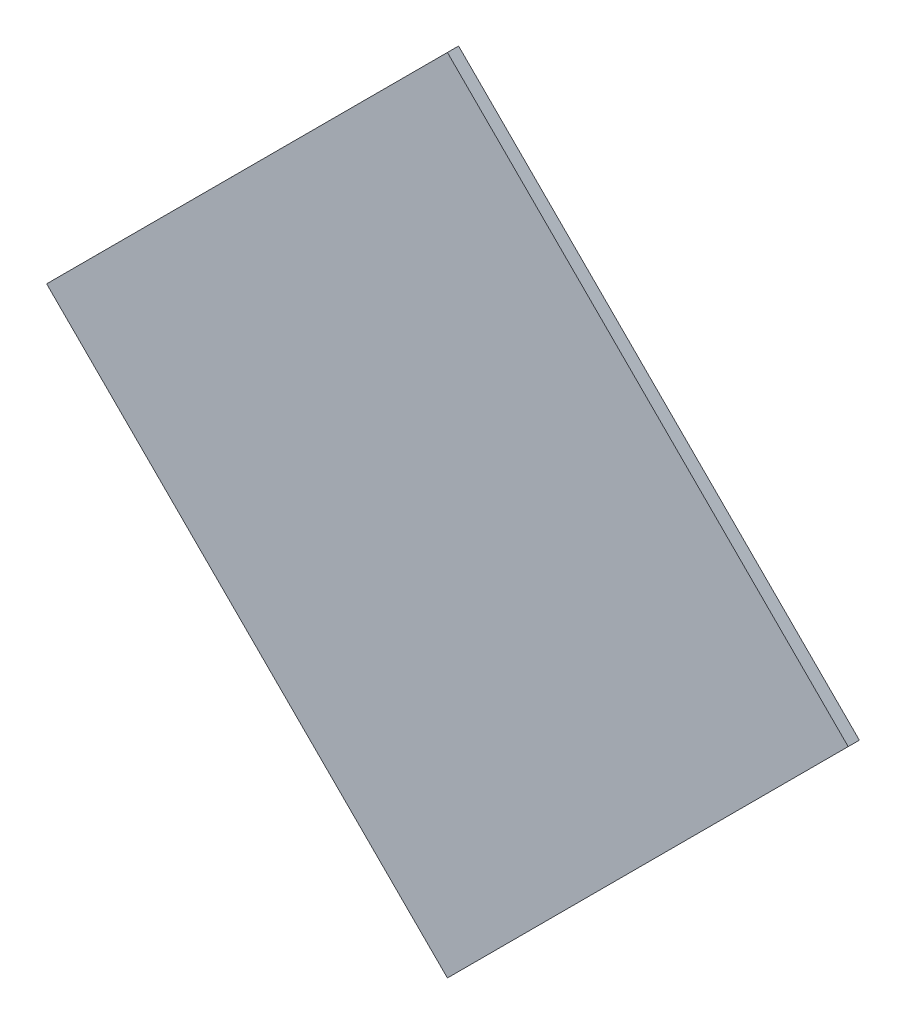
ISO-10303-21;
HEADER;
FILE_DESCRIPTION(('STEP AP214'),'2;1');
FILE_NAME('part.step','',(''),(''),'','','');
FILE_SCHEMA(('AUTOMOTIVE_DESIGN { 1 0 10303 214 1 1 1 1 }'));
ENDSEC;
DATA;
#1=APPLICATION_CONTEXT('core data for automotive mechanical design processes');
#2=APPLICATION_PROTOCOL_DEFINITION('international standard','automotive_design',2000,#1);
#3=PRODUCT_CONTEXT('',#1,'mechanical');
#4=PRODUCT('Part','Part','',(#3));
#5=PRODUCT_RELATED_PRODUCT_CATEGORY('part','',(#4));
#6=PRODUCT_DEFINITION_FORMATION('','',#4);
#7=PRODUCT_DEFINITION_CONTEXT('part definition',#1,'design');
#8=PRODUCT_DEFINITION('design','',#6,#7);
#9=PRODUCT_DEFINITION_SHAPE('','',#8);
#10=(LENGTH_UNIT() NAMED_UNIT(*) SI_UNIT(.MILLI.,.METRE.));
#11=(NAMED_UNIT(*) PLANE_ANGLE_UNIT() SI_UNIT($,.RADIAN.));
#12=(NAMED_UNIT(*) SI_UNIT($,.STERADIAN.) SOLID_ANGLE_UNIT());
#13=UNCERTAINTY_MEASURE_WITH_UNIT(LENGTH_MEASURE(1.E-05),#10,'distance_accuracy_value','');
#14=(GEOMETRIC_REPRESENTATION_CONTEXT(3) GLOBAL_UNCERTAINTY_ASSIGNED_CONTEXT((#13)) GLOBAL_UNIT_ASSIGNED_CONTEXT((#10,
#11,#12)) REPRESENTATION_CONTEXT('',''));
#15=CARTESIAN_POINT('',(0.,0.,0.));
#16=DIRECTION('',(0.,0.,1.));
#17=DIRECTION('',(1.,0.,0.));
#18=AXIS2_PLACEMENT_3D('',#15,#16,#17);
#19=CARTESIAN_POINT('',(-0.35920934,0.,0.));
#20=DIRECTION('',(-0.707109281179628,0.707104281184628,0.));
#21=DIRECTION('',(0.707104281184628,0.707109281179628,0.));
#22=AXIS2_PLACEMENT_3D('',#19,#20,#21);
#23=PLANE('',#22);
#24=DIRECTION('',(0.,0.,1.));
#25=VECTOR('',#24,1.);
#26=CARTESIAN_POINT('',(-0.35920934,0.,0.));
#27=LINE('',#26,#25);
#28=CARTESIAN_POINT('',(-0.35920934,0.,0.));
#29=VERTEX_POINT('',#28);
#30=CARTESIAN_POINT('',(-0.35920934,0.,0.00999998));
#31=VERTEX_POINT('',#30);
#32=EDGE_CURVE('E11',#29,#31,#27,.T.);
#33=ORIENTED_EDGE('',*,*,#32,.T.);
#34=DIRECTION('',(0.707104281184628,0.707109281179628,0.));
#35=VECTOR('',#34,1.);
#36=CARTESIAN_POINT('',(-0.35920934,0.,0.00999998));
#37=LINE('',#36,#35);
#38=CARTESIAN_POINT('',(0.,0.35921188,0.00999998));
#39=VERTEX_POINT('',#38);
#40=EDGE_CURVE('E25',#31,#39,#37,.T.);
#41=ORIENTED_EDGE('',*,*,#40,.T.);
#42=DIRECTION('',(0.,0.,1.));
#43=VECTOR('',#42,1.);
#44=CARTESIAN_POINT('',(0.,0.35921188,0.));
#45=LINE('',#44,#43);
#46=CARTESIAN_POINT('',(0.,0.35921188,0.));
#47=VERTEX_POINT('',#46);
#48=EDGE_CURVE('E73',#47,#39,#45,.T.);
#49=ORIENTED_EDGE('',*,*,#48,.F.);
#50=DIRECTION('',(0.707104281184628,0.707109281179628,0.));
#51=VECTOR('',#50,1.);
#52=CARTESIAN_POINT('',(-0.35920934,0.,0.));
#53=LINE('',#52,#51);
#54=EDGE_CURVE('E99',#29,#47,#53,.T.);
#55=ORIENTED_EDGE('',*,*,#54,.F.);
#56=EDGE_LOOP('',(#33,#41,#49,#55));
#57=FACE_BOUND('',#56,.T.);
#58=ADVANCED_FACE('F17',(#57),#23,.T.);
#59=CARTESIAN_POINT('',(0.,9.525011214072E-07,0.));
#60=DIRECTION('',(0.,0.,-1.));
#61=DIRECTION('',(-1.,0.,0.));
#62=AXIS2_PLACEMENT_3D('',#59,#60,#61);
#63=PLANE('',#62);
#64=ORIENTED_EDGE('',*,*,#54,.T.);
#65=DIRECTION('',(0.707104281184628,-0.707109281179628,0.));
#66=VECTOR('',#65,1.);
#67=CARTESIAN_POINT('',(0.,0.35921188,0.));
#68=LINE('',#67,#66);
#69=CARTESIAN_POINT('',(0.35920934,0.,0.));
#70=VERTEX_POINT('',#69);
#71=EDGE_CURVE('E95',#47,#70,#68,.T.);
#72=ORIENTED_EDGE('',*,*,#71,.T.);
#73=DIRECTION('',(-0.707106781186548,-0.707106781186548,0.));
#74=VECTOR('',#73,1.);
#75=CARTESIAN_POINT('',(0.35920934,0.,0.));
#76=LINE('',#75,#74);
#77=CARTESIAN_POINT('',(0.,-0.35920934,0.));
#78=VERTEX_POINT('',#77);
#79=EDGE_CURVE('E68',#70,#78,#76,.T.);
#80=ORIENTED_EDGE('',*,*,#79,.T.);
#81=DIRECTION('',(-0.707106781186548,0.707106781186548,0.));
#82=VECTOR('',#81,1.);
#83=CARTESIAN_POINT('',(0.,-0.35920934,0.));
#84=LINE('',#83,#82);
#85=EDGE_CURVE('E87',#78,#29,#84,.T.);
#86=ORIENTED_EDGE('',*,*,#85,.T.);
#87=EDGE_LOOP('',(#64,#72,#80,#86));
#88=FACE_BOUND('',#87,.T.);
#89=ADVANCED_FACE('F112',(#88),#63,.T.);
#90=CARTESIAN_POINT('',(0.,-0.35920934,0.));
#91=DIRECTION('',(-0.707106781186548,-0.707106781186548,0.));
#92=DIRECTION('',(-0.707106781186548,0.707106781186548,0.));
#93=AXIS2_PLACEMENT_3D('',#90,#91,#92);
#94=PLANE('',#93);
#95=DIRECTION('',(0.,0.,1.));
#96=VECTOR('',#95,1.);
#97=CARTESIAN_POINT('',(0.,-0.35920934,0.));
#98=LINE('',#97,#96);
#99=CARTESIAN_POINT('',(0.,-0.35920934,0.00999998));
#100=VERTEX_POINT('',#99);
#101=EDGE_CURVE('E83',#78,#100,#98,.T.);
#102=ORIENTED_EDGE('',*,*,#101,.T.);
#103=DIRECTION('',(-0.707106781186548,0.707106781186548,0.));
#104=VECTOR('',#103,1.);
#105=CARTESIAN_POINT('',(0.,-0.35920934,0.00999998));
#106=LINE('',#105,#104);
#107=EDGE_CURVE('E60',#100,#31,#106,.T.);
#108=ORIENTED_EDGE('',*,*,#107,.T.);
#109=ORIENTED_EDGE('',*,*,#32,.F.);
#110=ORIENTED_EDGE('',*,*,#85,.F.);
#111=EDGE_LOOP('',(#102,#108,#109,#110));
#112=FACE_BOUND('',#111,.T.);
#113=ADVANCED_FACE('F119',(#112),#94,.T.);
#114=CARTESIAN_POINT('',(0.,9.525011214072E-07,0.00999998));
#115=DIRECTION('',(0.,0.,-1.));
#116=DIRECTION('',(-1.,0.,0.));
#117=AXIS2_PLACEMENT_3D('',#114,#115,#116);
#118=PLANE('',#117);
#119=ORIENTED_EDGE('',*,*,#107,.F.);
#120=DIRECTION('',(-0.707106781186548,-0.707106781186548,0.));
#121=VECTOR('',#120,1.);
#122=CARTESIAN_POINT('',(0.35920934,0.,0.00999998));
#123=LINE('',#122,#121);
#124=CARTESIAN_POINT('',(0.35920934,0.,0.00999998));
#125=VERTEX_POINT('',#124);
#126=EDGE_CURVE('E54',#125,#100,#123,.T.);
#127=ORIENTED_EDGE('',*,*,#126,.F.);
#128=DIRECTION('',(0.707104281184628,-0.707109281179628,0.));
#129=VECTOR('',#128,1.);
#130=CARTESIAN_POINT('',(0.,0.35921188,0.00999998));
#131=LINE('',#130,#129);
#132=EDGE_CURVE('E58',#39,#125,#131,.T.);
#133=ORIENTED_EDGE('',*,*,#132,.F.);
#134=ORIENTED_EDGE('',*,*,#40,.F.);
#135=EDGE_LOOP('',(#119,#127,#133,#134));
#136=FACE_BOUND('',#135,.T.);
#137=ADVANCED_FACE('F56',(#136),#118,.F.);
#138=CARTESIAN_POINT('',(0.,0.35921188,0.));
#139=DIRECTION('',(0.707109281179628,0.707104281184628,0.));
#140=DIRECTION('',(0.707104281184628,-0.707109281179628,0.));
#141=AXIS2_PLACEMENT_3D('',#138,#139,#140);
#142=PLANE('',#141);
#143=ORIENTED_EDGE('',*,*,#48,.T.);
#144=ORIENTED_EDGE('',*,*,#132,.T.);
#145=DIRECTION('',(0.,0.,1.));
#146=VECTOR('',#145,1.);
#147=CARTESIAN_POINT('',(0.35920934,0.,0.));
#148=LINE('',#147,#146);
#149=EDGE_CURVE('E66',#70,#125,#148,.T.);
#150=ORIENTED_EDGE('',*,*,#149,.F.);
#151=ORIENTED_EDGE('',*,*,#71,.F.);
#152=EDGE_LOOP('',(#143,#144,#150,#151));
#153=FACE_BOUND('',#152,.T.);
#154=ADVANCED_FACE('F72',(#153),#142,.T.);
#155=CARTESIAN_POINT('',(0.35920934,0.,0.));
#156=DIRECTION('',(0.707106781186548,-0.707106781186548,0.));
#157=DIRECTION('',(-0.707106781186548,-0.707106781186548,0.));
#158=AXIS2_PLACEMENT_3D('',#155,#156,#157);
#159=PLANE('',#158);
#160=ORIENTED_EDGE('',*,*,#149,.T.);
#161=ORIENTED_EDGE('',*,*,#126,.T.);
#162=ORIENTED_EDGE('',*,*,#101,.F.);
#163=ORIENTED_EDGE('',*,*,#79,.F.);
#164=EDGE_LOOP('',(#160,#161,#162,#163));
#165=FACE_BOUND('',#164,.T.);
#166=ADVANCED_FACE('F67',(#165),#159,.T.);
#167=CLOSED_SHELL('',(#58,#89,#113,#137,#154,#166));
#168=MANIFOLD_SOLID_BREP('B1',#167);
#169=ADVANCED_BREP_SHAPE_REPRESENTATION('',(#18,#168),#14);
#170=SHAPE_DEFINITION_REPRESENTATION(#9,#169);
ENDSEC;
END-ISO-10303-21;
